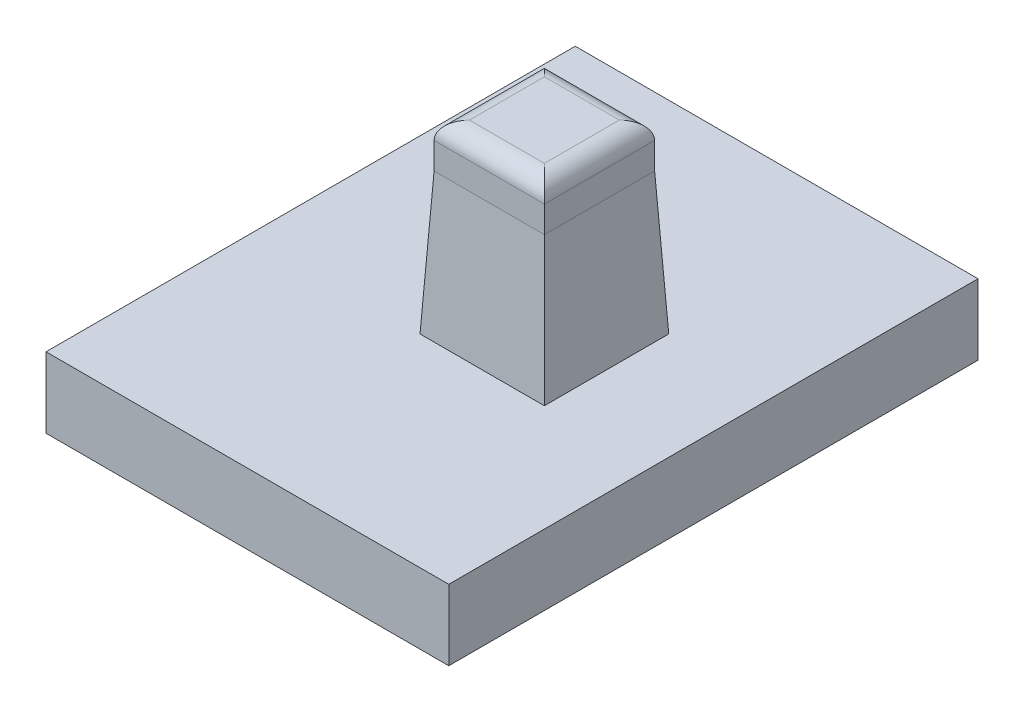
ISO-10303-21;
HEADER;
FILE_DESCRIPTION(('STEP AP214'),'2;1');
FILE_NAME('part.step','',(''),(''),'','','');
FILE_SCHEMA(('AUTOMOTIVE_DESIGN { 1 0 10303 214 1 1 1 1 }'));
ENDSEC;
DATA;
#1=APPLICATION_CONTEXT('core data for automotive mechanical design processes');
#2=APPLICATION_PROTOCOL_DEFINITION('international standard','automotive_design',2000,#1);
#3=PRODUCT_CONTEXT('',#1,'mechanical');
#4=PRODUCT('Part','Part','',(#3));
#5=PRODUCT_RELATED_PRODUCT_CATEGORY('part','',(#4));
#6=PRODUCT_DEFINITION_FORMATION('','',#4);
#7=PRODUCT_DEFINITION_CONTEXT('part definition',#1,'design');
#8=PRODUCT_DEFINITION('design','',#6,#7);
#9=PRODUCT_DEFINITION_SHAPE('','',#8);
#10=(LENGTH_UNIT() NAMED_UNIT(*) SI_UNIT(.MILLI.,.METRE.));
#11=(NAMED_UNIT(*) PLANE_ANGLE_UNIT() SI_UNIT($,.RADIAN.));
#12=(NAMED_UNIT(*) SI_UNIT($,.STERADIAN.) SOLID_ANGLE_UNIT());
#13=UNCERTAINTY_MEASURE_WITH_UNIT(LENGTH_MEASURE(1.E-05),#10,'distance_accuracy_value','');
#14=(GEOMETRIC_REPRESENTATION_CONTEXT(3) GLOBAL_UNCERTAINTY_ASSIGNED_CONTEXT((#13)) GLOBAL_UNIT_ASSIGNED_CONTEXT((#10,
#11,#12)) REPRESENTATION_CONTEXT('',''));
#15=CARTESIAN_POINT('',(0.,0.,0.));
#16=DIRECTION('',(0.,0.,1.));
#17=DIRECTION('',(1.,0.,0.));
#18=AXIS2_PLACEMENT_3D('',#15,#16,#17);
#19=CARTESIAN_POINT('',(0.,4.,0.));
#20=DIRECTION('',(0.,-1.,0.));
#21=DIRECTION('',(0.,0.,-1.));
#22=AXIS2_PLACEMENT_3D('',#19,#20,#21);
#23=PLANE('',#22);
#24=DIRECTION('',(1.,0.,0.));
#25=VECTOR('',#24,1.);
#26=CARTESIAN_POINT('',(0.,4.,-18.525));
#27=LINE('',#26,#25);
#28=CARTESIAN_POINT('',(9.725,4.,-18.525));
#29=VERTEX_POINT('',#28);
#30=CARTESIAN_POINT('',(16.775,4.,-18.525));
#31=VERTEX_POINT('',#30);
#32=EDGE_CURVE('E237',#29,#31,#27,.T.);
#33=ORIENTED_EDGE('',*,*,#32,.T.);
#34=DIRECTION('',(0.,0.,1.));
#35=VECTOR('',#34,1.);
#36=CARTESIAN_POINT('',(16.775,4.,0.));
#37=LINE('',#36,#35);
#38=CARTESIAN_POINT('',(16.775,4.,-11.475));
#39=VERTEX_POINT('',#38);
#40=EDGE_CURVE('E240',#31,#39,#37,.T.);
#41=ORIENTED_EDGE('',*,*,#40,.T.);
#42=DIRECTION('',(-1.,0.,0.));
#43=VECTOR('',#42,1.);
#44=CARTESIAN_POINT('',(0.,4.,-11.475));
#45=LINE('',#44,#43);
#46=CARTESIAN_POINT('',(9.725,4.,-11.475));
#47=VERTEX_POINT('',#46);
#48=EDGE_CURVE('E231',#39,#47,#45,.T.);
#49=ORIENTED_EDGE('',*,*,#48,.T.);
#50=DIRECTION('',(0.,0.,-1.));
#51=VECTOR('',#50,1.);
#52=CARTESIAN_POINT('',(9.725,4.,0.));
#53=LINE('',#52,#51);
#54=EDGE_CURVE('E234',#47,#29,#53,.T.);
#55=ORIENTED_EDGE('',*,*,#54,.T.);
#56=EDGE_LOOP('',(#33,#41,#49,#55));
#57=FACE_BOUND('',#56,.T.);
#58=DIRECTION('',(1.,0.,0.));
#59=VECTOR('',#58,1.);
#60=CARTESIAN_POINT('',(0.,4.,0.));
#61=LINE('',#60,#59);
#62=CARTESIAN_POINT('',(0.,4.,0.));
#63=VERTEX_POINT('',#62);
#64=CARTESIAN_POINT('',(22.8294912426967,4.,0.));
#65=VERTEX_POINT('',#64);
#66=EDGE_CURVE('E296',#63,#65,#61,.T.);
#67=ORIENTED_EDGE('',*,*,#66,.T.);
#68=DIRECTION('',(0.,0.,-1.));
#69=VECTOR('',#68,1.);
#70=CARTESIAN_POINT('',(22.8294912426967,4.,0.));
#71=LINE('',#70,#69);
#72=CARTESIAN_POINT('',(22.8294912426967,4.,-30.));
#73=VERTEX_POINT('',#72);
#74=EDGE_CURVE('E142',#65,#73,#71,.T.);
#75=ORIENTED_EDGE('',*,*,#74,.T.);
#76=DIRECTION('',(-1.,0.,0.));
#77=VECTOR('',#76,1.);
#78=CARTESIAN_POINT('',(0.,4.,-30.));
#79=LINE('',#78,#77);
#80=CARTESIAN_POINT('',(0.,4.,-30.));
#81=VERTEX_POINT('',#80);
#82=EDGE_CURVE('E178',#73,#81,#79,.T.);
#83=ORIENTED_EDGE('',*,*,#82,.T.);
#84=DIRECTION('',(0.,0.,1.));
#85=VECTOR('',#84,1.);
#86=CARTESIAN_POINT('',(0.,4.,0.));
#87=LINE('',#86,#85);
#88=EDGE_CURVE('E168',#81,#63,#87,.T.);
#89=ORIENTED_EDGE('',*,*,#88,.T.);
#90=EDGE_LOOP('',(#67,#75,#83,#89));
#91=FACE_BOUND('',#90,.T.);
#92=ADVANCED_FACE('F45',(#57,#91),#23,.F.);
#93=CARTESIAN_POINT('',(0.,0.,0.));
#94=DIRECTION('',(0.,-1.,0.));
#95=DIRECTION('',(0.,0.,-1.));
#96=AXIS2_PLACEMENT_3D('',#93,#94,#95);
#97=PLANE('',#96);
#98=DIRECTION('',(0.,0.,1.));
#99=VECTOR('',#98,1.);
#100=CARTESIAN_POINT('',(22.8294912426967,0.,-58.4020531329729));
#101=LINE('',#100,#99);
#102=CARTESIAN_POINT('',(22.8294912426967,0.,-30.));
#103=VERTEX_POINT('',#102);
#104=CARTESIAN_POINT('',(22.8294912426967,0.,0.));
#105=VERTEX_POINT('',#104);
#106=EDGE_CURVE('E139',#103,#105,#101,.T.);
#107=ORIENTED_EDGE('',*,*,#106,.T.);
#108=DIRECTION('',(1.,0.,0.));
#109=VECTOR('',#108,1.);
#110=CARTESIAN_POINT('',(0.,0.,0.));
#111=LINE('',#110,#109);
#112=CARTESIAN_POINT('',(0.,0.,0.));
#113=VERTEX_POINT('',#112);
#114=EDGE_CURVE('E153',#113,#105,#111,.T.);
#115=ORIENTED_EDGE('',*,*,#114,.F.);
#116=DIRECTION('',(0.,0.,1.));
#117=VECTOR('',#116,1.);
#118=CARTESIAN_POINT('',(0.,0.,0.));
#119=LINE('',#118,#117);
#120=CARTESIAN_POINT('',(0.,0.,-30.));
#121=VERTEX_POINT('',#120);
#122=EDGE_CURVE('E164',#121,#113,#119,.T.);
#123=ORIENTED_EDGE('',*,*,#122,.F.);
#124=DIRECTION('',(-1.,0.,0.));
#125=VECTOR('',#124,1.);
#126=CARTESIAN_POINT('',(0.,0.,-30.));
#127=LINE('',#126,#125);
#128=EDGE_CURVE('E155',#103,#121,#127,.T.);
#129=ORIENTED_EDGE('',*,*,#128,.F.);
#130=EDGE_LOOP('',(#107,#115,#123,#129));
#131=FACE_BOUND('',#130,.T.);
#132=ADVANCED_FACE('F151',(#131),#97,.T.);
#133=CARTESIAN_POINT('',(0.,4.,0.));
#134=DIRECTION('',(1.,0.,0.));
#135=DIRECTION('',(0.,0.,-1.));
#136=AXIS2_PLACEMENT_3D('',#133,#134,#135);
#137=PLANE('',#136);
#138=ORIENTED_EDGE('',*,*,#122,.T.);
#139=DIRECTION('',(0.,-1.,0.));
#140=VECTOR('',#139,1.);
#141=CARTESIAN_POINT('',(0.,4.,0.));
#142=LINE('',#141,#140);
#143=EDGE_CURVE('E161',#63,#113,#142,.T.);
#144=ORIENTED_EDGE('',*,*,#143,.F.);
#145=ORIENTED_EDGE('',*,*,#88,.F.);
#146=DIRECTION('',(0.,-1.,0.));
#147=VECTOR('',#146,1.);
#148=CARTESIAN_POINT('',(0.,4.,-30.));
#149=LINE('',#148,#147);
#150=EDGE_CURVE('E174',#81,#121,#149,.T.);
#151=ORIENTED_EDGE('',*,*,#150,.T.);
#152=EDGE_LOOP('',(#138,#144,#145,#151));
#153=FACE_BOUND('',#152,.T.);
#154=ADVANCED_FACE('F305',(#153),#137,.F.);
#155=CARTESIAN_POINT('',(0.,4.,0.));
#156=DIRECTION('',(0.,0.,-1.));
#157=DIRECTION('',(-1.,0.,0.));
#158=AXIS2_PLACEMENT_3D('',#155,#156,#157);
#159=PLANE('',#158);
#160=ORIENTED_EDGE('',*,*,#114,.T.);
#161=DIRECTION('',(0.,1.,0.));
#162=VECTOR('',#161,1.);
#163=CARTESIAN_POINT('',(22.8294912426967,4.,0.));
#164=LINE('',#163,#162);
#165=EDGE_CURVE('E136',#105,#65,#164,.T.);
#166=ORIENTED_EDGE('',*,*,#165,.T.);
#167=ORIENTED_EDGE('',*,*,#66,.F.);
#168=ORIENTED_EDGE('',*,*,#143,.T.);
#169=EDGE_LOOP('',(#160,#166,#167,#168));
#170=FACE_BOUND('',#169,.T.);
#171=ADVANCED_FACE('F159',(#170),#159,.F.);
#172=CARTESIAN_POINT('',(0.,4.,-30.));
#173=DIRECTION('',(0.,0.,1.));
#174=DIRECTION('',(1.,0.,0.));
#175=AXIS2_PLACEMENT_3D('',#172,#173,#174);
#176=PLANE('',#175);
#177=ORIENTED_EDGE('',*,*,#82,.F.);
#178=DIRECTION('',(0.,-1.,0.));
#179=VECTOR('',#178,1.);
#180=CARTESIAN_POINT('',(22.8294912426967,4.,-30.));
#181=LINE('',#180,#179);
#182=EDGE_CURVE('E181',#73,#103,#181,.T.);
#183=ORIENTED_EDGE('',*,*,#182,.T.);
#184=ORIENTED_EDGE('',*,*,#128,.T.);
#185=ORIENTED_EDGE('',*,*,#150,.F.);
#186=EDGE_LOOP('',(#177,#183,#184,#185));
#187=FACE_BOUND('',#186,.T.);
#188=ADVANCED_FACE('F303',(#187),#176,.F.);
#189=CARTESIAN_POINT('',(10.125,-8.83883476483186,-11.875));
#190=DIRECTION('',(0.,0.,1.));
#191=DIRECTION('',(1.,0.,0.));
#192=AXIS2_PLACEMENT_3D('',#189,#190,#191);
#193=PLANE('',#192);
#194=DIRECTION('',(0.,1.,0.));
#195=VECTOR('',#194,1.);
#196=CARTESIAN_POINT('',(10.125,-8.83883476483186,-11.875));
#197=LINE('',#196,#195);
#198=CARTESIAN_POINT('',(10.125,11.9999999999995,-11.875));
#199=VERTEX_POINT('',#198);
#200=CARTESIAN_POINT('',(10.125,13.5,-11.875));
#201=VERTEX_POINT('',#200);
#202=EDGE_CURVE('E170',#199,#201,#197,.T.);
#203=ORIENTED_EDGE('',*,*,#202,.F.);
#204=DIRECTION('',(1.,0.,0.));
#205=VECTOR('',#204,1.);
#206=CARTESIAN_POINT('',(10.125,11.9999999999995,-11.875));
#207=LINE('',#206,#205);
#208=CARTESIAN_POINT('',(16.375,11.9999999999995,-11.875));
#209=VERTEX_POINT('',#208);
#210=EDGE_CURVE('E11',#199,#209,#207,.T.);
#211=ORIENTED_EDGE('',*,*,#210,.T.);
#212=DIRECTION('',(0.,1.,0.));
#213=VECTOR('',#212,1.);
#214=CARTESIAN_POINT('',(16.375,-8.83883476483186,-11.875));
#215=LINE('',#214,#213);
#216=CARTESIAN_POINT('',(16.375,13.5,-11.875));
#217=VERTEX_POINT('',#216);
#218=EDGE_CURVE('E147',#209,#217,#215,.T.);
#219=ORIENTED_EDGE('',*,*,#218,.T.);
#220=DIRECTION('',(1.,0.,0.));
#221=VECTOR('',#220,1.);
#222=CARTESIAN_POINT('',(10.125,13.5,-11.875));
#223=LINE('',#222,#221);
#224=EDGE_CURVE('E205',#217,#201,#223,.F.);
#225=ORIENTED_EDGE('',*,*,#224,.T.);
#226=EDGE_LOOP('',(#203,#211,#219,#225));
#227=FACE_BOUND('',#226,.T.);
#228=ADVANCED_FACE('F320',(#227),#193,.T.);
#229=CARTESIAN_POINT('',(10.125,-8.83883476483186,-18.125));
#230=DIRECTION('',(0.,0.,-1.));
#231=DIRECTION('',(-1.,0.,0.));
#232=AXIS2_PLACEMENT_3D('',#229,#230,#231);
#233=PLANE('',#232);
#234=DIRECTION('',(0.,1.,0.));
#235=VECTOR('',#234,1.);
#236=CARTESIAN_POINT('',(16.375,-8.83883476483186,-18.125));
#237=LINE('',#236,#235);
#238=CARTESIAN_POINT('',(16.375,11.9999999999995,-18.125));
#239=VERTEX_POINT('',#238);
#240=CARTESIAN_POINT('',(16.375,13.5,-18.125));
#241=VERTEX_POINT('',#240);
#242=EDGE_CURVE('E280',#239,#241,#237,.T.);
#243=ORIENTED_EDGE('',*,*,#242,.F.);
#244=DIRECTION('',(-1.,0.,0.));
#245=VECTOR('',#244,1.);
#246=CARTESIAN_POINT('',(10.125,11.9999999999995,-18.125));
#247=LINE('',#246,#245);
#248=CARTESIAN_POINT('',(10.125,11.9999999999995,-18.125));
#249=VERTEX_POINT('',#248);
#250=EDGE_CURVE('E71',#239,#249,#247,.T.);
#251=ORIENTED_EDGE('',*,*,#250,.T.);
#252=DIRECTION('',(0.,1.,0.));
#253=VECTOR('',#252,1.);
#254=CARTESIAN_POINT('',(10.125,-8.83883476483186,-18.125));
#255=LINE('',#254,#253);
#256=CARTESIAN_POINT('',(10.125,13.5,-18.125));
#257=VERTEX_POINT('',#256);
#258=EDGE_CURVE('E284',#249,#257,#255,.T.);
#259=ORIENTED_EDGE('',*,*,#258,.T.);
#260=DIRECTION('',(-1.,0.,0.));
#261=VECTOR('',#260,1.);
#262=CARTESIAN_POINT('',(10.125,13.5,-18.125));
#263=LINE('',#262,#261);
#264=EDGE_CURVE('E197',#257,#241,#263,.F.);
#265=ORIENTED_EDGE('',*,*,#264,.T.);
#266=EDGE_LOOP('',(#243,#251,#259,#265));
#267=FACE_BOUND('',#266,.T.);
#268=ADVANCED_FACE('F281',(#267),#233,.T.);
#269=CARTESIAN_POINT('',(16.375,-8.83883476483186,-18.125));
#270=DIRECTION('',(1.,0.,0.));
#271=DIRECTION('',(0.,0.,-1.));
#272=AXIS2_PLACEMENT_3D('',#269,#270,#271);
#273=PLANE('',#272);
#274=ORIENTED_EDGE('',*,*,#218,.F.);
#275=DIRECTION('',(0.,0.,-1.));
#276=VECTOR('',#275,1.);
#277=CARTESIAN_POINT('',(16.375,11.9999999999995,-18.125));
#278=LINE('',#277,#276);
#279=EDGE_CURVE('E213',#209,#239,#278,.T.);
#280=ORIENTED_EDGE('',*,*,#279,.T.);
#281=ORIENTED_EDGE('',*,*,#242,.T.);
#282=DIRECTION('',(0.,0.,-1.));
#283=VECTOR('',#282,1.);
#284=CARTESIAN_POINT('',(16.375,13.5,-18.125));
#285=LINE('',#284,#283);
#286=EDGE_CURVE('E201',#241,#217,#285,.F.);
#287=ORIENTED_EDGE('',*,*,#286,.T.);
#288=EDGE_LOOP('',(#274,#280,#281,#287));
#289=FACE_BOUND('',#288,.T.);
#290=ADVANCED_FACE('F279',(#289),#273,.T.);
#291=CARTESIAN_POINT('',(10.125,-8.83883476483186,-18.125));
#292=DIRECTION('',(-1.,0.,0.));
#293=DIRECTION('',(0.,0.,1.));
#294=AXIS2_PLACEMENT_3D('',#291,#292,#293);
#295=PLANE('',#294);
#296=ORIENTED_EDGE('',*,*,#258,.F.);
#297=DIRECTION('',(0.,0.,1.));
#298=VECTOR('',#297,1.);
#299=CARTESIAN_POINT('',(10.125,11.9999999999995,-18.125));
#300=LINE('',#299,#298);
#301=EDGE_CURVE('E56',#249,#199,#300,.T.);
#302=ORIENTED_EDGE('',*,*,#301,.T.);
#303=ORIENTED_EDGE('',*,*,#202,.T.);
#304=DIRECTION('',(0.,0.,1.));
#305=VECTOR('',#304,1.);
#306=CARTESIAN_POINT('',(10.125,13.5,-18.125));
#307=LINE('',#306,#305);
#308=EDGE_CURVE('E209',#201,#257,#307,.F.);
#309=ORIENTED_EDGE('',*,*,#308,.T.);
#310=EDGE_LOOP('',(#296,#302,#303,#309));
#311=FACE_BOUND('',#310,.T.);
#312=ADVANCED_FACE('F334',(#311),#295,.T.);
#313=CARTESIAN_POINT('',(0.,14.5,0.));
#314=DIRECTION('',(0.,1.,0.));
#315=DIRECTION('',(0.,0.,1.));
#316=AXIS2_PLACEMENT_3D('',#313,#314,#315);
#317=PLANE('',#316);
#318=DIRECTION('',(0.,0.,-1.));
#319=VECTOR('',#318,1.);
#320=CARTESIAN_POINT('',(15.375,14.5,0.));
#321=LINE('',#320,#319);
#322=CARTESIAN_POINT('',(15.375,14.5,-12.875));
#323=VERTEX_POINT('',#322);
#324=CARTESIAN_POINT('',(15.375,14.5,-17.125));
#325=VERTEX_POINT('',#324);
#326=EDGE_CURVE('E190',#323,#325,#321,.T.);
#327=ORIENTED_EDGE('',*,*,#326,.T.);
#328=DIRECTION('',(-1.,0.,0.));
#329=VECTOR('',#328,1.);
#330=CARTESIAN_POINT('',(0.,14.5,-17.125));
#331=LINE('',#330,#329);
#332=CARTESIAN_POINT('',(11.125,14.5,-17.125));
#333=VERTEX_POINT('',#332);
#334=EDGE_CURVE('E193',#325,#333,#331,.T.);
#335=ORIENTED_EDGE('',*,*,#334,.T.);
#336=DIRECTION('',(0.,0.,1.));
#337=VECTOR('',#336,1.);
#338=CARTESIAN_POINT('',(11.125,14.5,0.));
#339=LINE('',#338,#337);
#340=CARTESIAN_POINT('',(11.125,14.5,-12.875));
#341=VERTEX_POINT('',#340);
#342=EDGE_CURVE('E184',#333,#341,#339,.T.);
#343=ORIENTED_EDGE('',*,*,#342,.T.);
#344=DIRECTION('',(1.,0.,0.));
#345=VECTOR('',#344,1.);
#346=CARTESIAN_POINT('',(0.,14.5,-12.875));
#347=LINE('',#346,#345);
#348=EDGE_CURVE('E187',#341,#323,#347,.T.);
#349=ORIENTED_EDGE('',*,*,#348,.T.);
#350=EDGE_LOOP('',(#327,#335,#343,#349));
#351=FACE_BOUND('',#350,.T.);
#352=ADVANCED_FACE('F347',(#351),#317,.T.);
#353=CARTESIAN_POINT('',(22.8294912426967,0.,-58.4020531329729));
#354=DIRECTION('',(-1.,0.,0.));
#355=DIRECTION('',(0.,0.,1.));
#356=AXIS2_PLACEMENT_3D('',#353,#354,#355);
#357=PLANE('',#356);
#358=ORIENTED_EDGE('',*,*,#106,.F.);
#359=ORIENTED_EDGE('',*,*,#182,.F.);
#360=ORIENTED_EDGE('',*,*,#74,.F.);
#361=ORIENTED_EDGE('',*,*,#165,.F.);
#362=EDGE_LOOP('',(#358,#359,#360,#361));
#363=FACE_BOUND('',#362,.T.);
#364=ADVANCED_FACE('F138',(#363),#357,.F.);
#365=CARTESIAN_POINT('',(0.,13.5,-12.875));
#366=DIRECTION('',(1.,0.,0.));
#367=DIRECTION('',(0.,0.,-1.));
#368=AXIS2_PLACEMENT_3D('',#365,#366,#367);
#369=CYLINDRICAL_SURFACE('',#368,1.);
#370=CARTESIAN_POINT('',(11.125,13.5,-12.875));
#371=DIRECTION('',(0.707106781186547,0.,0.707106781186547));
#372=DIRECTION('',(-0.707106781186547,0.,0.707106781186547));
#373=AXIS2_PLACEMENT_3D('',#370,#371,#372);
#374=ELLIPSE('',#373,1.41421356237309,1.);
#375=EDGE_CURVE('E221',#201,#341,#374,.F.);
#376=ORIENTED_EDGE('',*,*,#375,.F.);
#377=ORIENTED_EDGE('',*,*,#224,.F.);
#378=CARTESIAN_POINT('',(15.375,13.5,-12.875));
#379=DIRECTION('',(0.707106781186547,0.,-0.707106781186547));
#380=DIRECTION('',(0.707106781186547,0.,0.707106781186547));
#381=AXIS2_PLACEMENT_3D('',#378,#379,#380);
#382=ELLIPSE('',#381,1.41421356237309,1.);
#383=EDGE_CURVE('E157',#323,#217,#382,.T.);
#384=ORIENTED_EDGE('',*,*,#383,.F.);
#385=ORIENTED_EDGE('',*,*,#348,.F.);
#386=EDGE_LOOP('',(#376,#377,#384,#385));
#387=FACE_BOUND('',#386,.T.);
#388=ADVANCED_FACE('F353',(#387),#369,.T.);
#389=CARTESIAN_POINT('',(15.375,13.5,0.));
#390=DIRECTION('',(0.,0.,-1.));
#391=DIRECTION('',(-1.,0.,0.));
#392=AXIS2_PLACEMENT_3D('',#389,#390,#391);
#393=CYLINDRICAL_SURFACE('',#392,1.);
#394=ORIENTED_EDGE('',*,*,#383,.T.);
#395=ORIENTED_EDGE('',*,*,#286,.F.);
#396=CARTESIAN_POINT('',(15.375,13.5,-17.125));
#397=DIRECTION('',(-0.707106781186547,0.,-0.707106781186547));
#398=DIRECTION('',(0.707106781186547,0.,-0.707106781186547));
#399=AXIS2_PLACEMENT_3D('',#396,#397,#398);
#400=ELLIPSE('',#399,1.41421356237309,1.);
#401=EDGE_CURVE('E217',#325,#241,#400,.T.);
#402=ORIENTED_EDGE('',*,*,#401,.F.);
#403=ORIENTED_EDGE('',*,*,#326,.F.);
#404=EDGE_LOOP('',(#394,#395,#402,#403));
#405=FACE_BOUND('',#404,.T.);
#406=ADVANCED_FACE('F351',(#405),#393,.T.);
#407=CARTESIAN_POINT('',(11.125,13.5,0.));
#408=DIRECTION('',(0.,0.,1.));
#409=DIRECTION('',(1.,0.,0.));
#410=AXIS2_PLACEMENT_3D('',#407,#408,#409);
#411=CYLINDRICAL_SURFACE('',#410,1.);
#412=ORIENTED_EDGE('',*,*,#375,.T.);
#413=ORIENTED_EDGE('',*,*,#342,.F.);
#414=CARTESIAN_POINT('',(11.125,13.5,-17.125));
#415=DIRECTION('',(-0.707106781186547,0.,0.707106781186547));
#416=DIRECTION('',(0.707106781186547,0.,0.707106781186547));
#417=AXIS2_PLACEMENT_3D('',#414,#415,#416);
#418=ELLIPSE('',#417,1.41421356237309,1.);
#419=EDGE_CURVE('E214',#257,#333,#418,.F.);
#420=ORIENTED_EDGE('',*,*,#419,.F.);
#421=ORIENTED_EDGE('',*,*,#308,.F.);
#422=EDGE_LOOP('',(#412,#413,#420,#421));
#423=FACE_BOUND('',#422,.T.);
#424=ADVANCED_FACE('F344',(#423),#411,.T.);
#425=CARTESIAN_POINT('',(0.,13.5,-17.125));
#426=DIRECTION('',(-1.,0.,0.));
#427=DIRECTION('',(0.,0.,1.));
#428=AXIS2_PLACEMENT_3D('',#425,#426,#427);
#429=CYLINDRICAL_SURFACE('',#428,1.);
#430=ORIENTED_EDGE('',*,*,#401,.T.);
#431=ORIENTED_EDGE('',*,*,#264,.F.);
#432=ORIENTED_EDGE('',*,*,#419,.T.);
#433=ORIENTED_EDGE('',*,*,#334,.F.);
#434=EDGE_LOOP('',(#430,#431,#432,#433));
#435=FACE_BOUND('',#434,.T.);
#436=ADVANCED_FACE('F339',(#435),#429,.T.);
#437=CARTESIAN_POINT('',(10.125,11.9999999999995,-18.125));
#438=DIRECTION('',(0.998752338877844,-0.0499376169438957,0.));
#439=DIRECTION('',(0.,0.,1.));
#440=AXIS2_PLACEMENT_3D('',#437,#438,#439);
#441=PLANE('',#440);
#442=DIRECTION('',(-0.0498754668053851,-0.997509336107633,-0.0498754668053851));
#443=VECTOR('',#442,1.);
#444=CARTESIAN_POINT('',(10.125,11.9999999999995,-18.125));
#445=LINE('',#444,#443);
#446=EDGE_CURVE('E253',#29,#249,#445,.F.);
#447=ORIENTED_EDGE('',*,*,#446,.F.);
#448=ORIENTED_EDGE('',*,*,#54,.F.);
#449=DIRECTION('',(-0.0498754668053851,-0.997509336107633,0.0498754668053851));
#450=VECTOR('',#449,1.);
#451=CARTESIAN_POINT('',(10.125,11.9999999999995,-11.875));
#452=LINE('',#451,#450);
#453=EDGE_CURVE('E50',#199,#47,#452,.T.);
#454=ORIENTED_EDGE('',*,*,#453,.F.);
#455=ORIENTED_EDGE('',*,*,#301,.F.);
#456=EDGE_LOOP('',(#447,#448,#454,#455));
#457=FACE_BOUND('',#456,.T.);
#458=ADVANCED_FACE('F48',(#457),#441,.F.);
#459=CARTESIAN_POINT('',(10.125,11.9999999999995,-11.875));
#460=DIRECTION('',(0.,-0.0499376169438957,-0.998752338877844));
#461=DIRECTION('',(1.,0.,0.));
#462=AXIS2_PLACEMENT_3D('',#459,#460,#461);
#463=PLANE('',#462);
#464=ORIENTED_EDGE('',*,*,#453,.T.);
#465=ORIENTED_EDGE('',*,*,#48,.F.);
#466=DIRECTION('',(-0.0498754668053851,0.997509336107633,-0.0498754668053851));
#467=VECTOR('',#466,1.);
#468=CARTESIAN_POINT('',(16.3594527363184,12.3109452736313,-11.8905472636816));
#469=LINE('',#468,#467);
#470=EDGE_CURVE('E251',#209,#39,#469,.F.);
#471=ORIENTED_EDGE('',*,*,#470,.F.);
#472=ORIENTED_EDGE('',*,*,#210,.F.);
#473=EDGE_LOOP('',(#464,#465,#471,#472));
#474=FACE_BOUND('',#473,.T.);
#475=ADVANCED_FACE('F265',(#474),#463,.F.);
#476=CARTESIAN_POINT('',(10.125,11.9999999999995,-18.125));
#477=DIRECTION('',(0.,-0.0499376169438957,0.998752338877844));
#478=DIRECTION('',(-1.,0.,0.));
#479=AXIS2_PLACEMENT_3D('',#476,#477,#478);
#480=PLANE('',#479);
#481=ORIENTED_EDGE('',*,*,#446,.T.);
#482=ORIENTED_EDGE('',*,*,#250,.F.);
#483=DIRECTION('',(0.0498754668053851,-0.997509336107633,-0.0498754668053851));
#484=VECTOR('',#483,1.);
#485=CARTESIAN_POINT('',(16.3594527363184,12.3109452736313,-18.1094527363184));
#486=LINE('',#485,#484);
#487=EDGE_CURVE('E248',#31,#239,#486,.F.);
#488=ORIENTED_EDGE('',*,*,#487,.F.);
#489=ORIENTED_EDGE('',*,*,#32,.F.);
#490=EDGE_LOOP('',(#481,#482,#488,#489));
#491=FACE_BOUND('',#490,.T.);
#492=ADVANCED_FACE('F276',(#491),#480,.F.);
#493=CARTESIAN_POINT('',(16.375,11.9999999999995,-18.125));
#494=DIRECTION('',(-0.998752338877844,-0.0499376169438957,0.));
#495=DIRECTION('',(0.,0.,-1.));
#496=AXIS2_PLACEMENT_3D('',#493,#494,#495);
#497=PLANE('',#496);
#498=ORIENTED_EDGE('',*,*,#470,.T.);
#499=ORIENTED_EDGE('',*,*,#40,.F.);
#500=ORIENTED_EDGE('',*,*,#487,.T.);
#501=ORIENTED_EDGE('',*,*,#279,.F.);
#502=EDGE_LOOP('',(#498,#499,#500,#501));
#503=FACE_BOUND('',#502,.T.);
#504=ADVANCED_FACE('F274',(#503),#497,.F.);
#505=CLOSED_SHELL('',(#92,#132,#154,#171,#188,#228,#268,#290,#312,#352,#364,#388,#406,#424,#436,
#458,#475,#492,#504));
#506=MANIFOLD_SOLID_BREP('B2',#505);
#507=ADVANCED_BREP_SHAPE_REPRESENTATION('',(#18,#506),#14);
#508=SHAPE_DEFINITION_REPRESENTATION(#9,#507);
ENDSEC;
END-ISO-10303-21;
